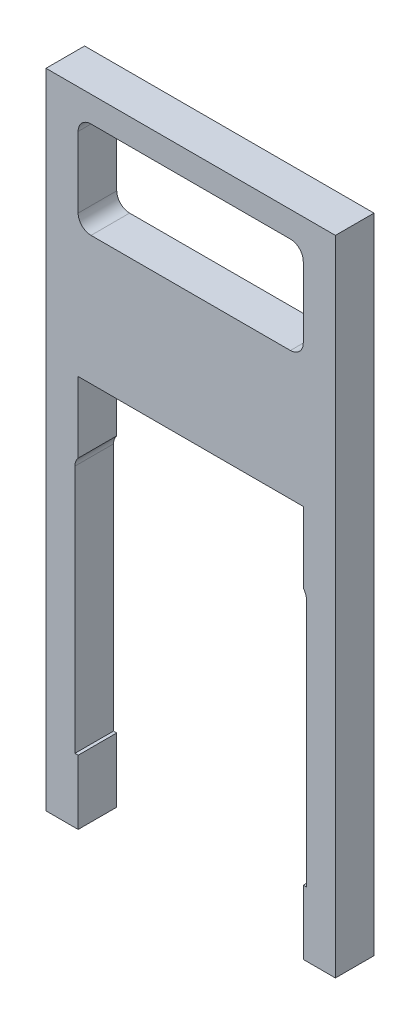
ISO-10303-21;
HEADER;
FILE_DESCRIPTION(('STEP AP214'),'2;1');
FILE_NAME('part.step','',(''),(''),'','','');
FILE_SCHEMA(('AUTOMOTIVE_DESIGN { 1 0 10303 214 1 1 1 1 }'));
ENDSEC;
DATA;
#1=APPLICATION_CONTEXT('core data for automotive mechanical design processes');
#2=APPLICATION_PROTOCOL_DEFINITION('international standard','automotive_design',2000,#1);
#3=PRODUCT_CONTEXT('',#1,'mechanical');
#4=PRODUCT('Part','Part','',(#3));
#5=PRODUCT_RELATED_PRODUCT_CATEGORY('part','',(#4));
#6=PRODUCT_DEFINITION_FORMATION('','',#4);
#7=PRODUCT_DEFINITION_CONTEXT('part definition',#1,'design');
#8=PRODUCT_DEFINITION('design','',#6,#7);
#9=PRODUCT_DEFINITION_SHAPE('','',#8);
#10=(LENGTH_UNIT() NAMED_UNIT(*) SI_UNIT(.MILLI.,.METRE.));
#11=(NAMED_UNIT(*) PLANE_ANGLE_UNIT() SI_UNIT($,.RADIAN.));
#12=(NAMED_UNIT(*) SI_UNIT($,.STERADIAN.) SOLID_ANGLE_UNIT());
#13=UNCERTAINTY_MEASURE_WITH_UNIT(LENGTH_MEASURE(1.E-05),#10,'distance_accuracy_value','');
#14=(GEOMETRIC_REPRESENTATION_CONTEXT(3) GLOBAL_UNCERTAINTY_ASSIGNED_CONTEXT((#13)) GLOBAL_UNIT_ASSIGNED_CONTEXT((#10,
#11,#12)) REPRESENTATION_CONTEXT('',''));
#15=CARTESIAN_POINT('',(0.,0.,0.));
#16=DIRECTION('',(0.,0.,1.));
#17=DIRECTION('',(1.,0.,0.));
#18=AXIS2_PLACEMENT_3D('',#15,#16,#17);
#19=CARTESIAN_POINT('',(22.225,58.42,0.));
#20=DIRECTION('',(1.,0.,0.));
#21=DIRECTION('',(0.,1.,0.));
#22=AXIS2_PLACEMENT_3D('',#19,#20,#21);
#23=PLANE('',#22);
#24=DIRECTION('',(0.,1.,0.));
#25=VECTOR('',#24,1.);
#26=CARTESIAN_POINT('',(22.225,58.42,7.62));
#27=LINE('',#26,#25);
#28=CARTESIAN_POINT('',(22.225,0.,7.62));
#29=VERTEX_POINT('',#28);
#30=CARTESIAN_POINT('',(22.225,13.97,7.62));
#31=VERTEX_POINT('',#30);
#32=EDGE_CURVE('E224',#29,#31,#27,.T.);
#33=ORIENTED_EDGE('',*,*,#32,.T.);
#34=DIRECTION('',(0.,0.,1.));
#35=VECTOR('',#34,1.);
#36=CARTESIAN_POINT('',(22.225,13.97,-51.1953367016958));
#37=LINE('',#36,#35);
#38=CARTESIAN_POINT('',(22.225,13.97,0.));
#39=VERTEX_POINT('',#38);
#40=EDGE_CURVE('E207',#39,#31,#37,.T.);
#41=ORIENTED_EDGE('',*,*,#40,.F.);
#42=DIRECTION('',(0.,1.,0.));
#43=VECTOR('',#42,1.);
#44=CARTESIAN_POINT('',(22.225,58.42,0.));
#45=LINE('',#44,#43);
#46=CARTESIAN_POINT('',(22.225,0.,0.));
#47=VERTEX_POINT('',#46);
#48=EDGE_CURVE('E221',#47,#39,#45,.T.);
#49=ORIENTED_EDGE('',*,*,#48,.F.);
#50=DIRECTION('',(0.,0.,1.));
#51=VECTOR('',#50,1.);
#52=CARTESIAN_POINT('',(22.225,0.,0.));
#53=LINE('',#52,#51);
#54=EDGE_CURVE('E244',#47,#29,#53,.T.);
#55=ORIENTED_EDGE('',*,*,#54,.T.);
#56=EDGE_LOOP('',(#33,#41,#49,#55));
#57=FACE_BOUND('',#56,.T.);
#58=ADVANCED_FACE('F43',(#57),#23,.F.);
#59=CARTESIAN_POINT('',(-22.225,58.42,0.));
#60=DIRECTION('',(-1.,0.,0.));
#61=DIRECTION('',(0.,-1.,0.));
#62=AXIS2_PLACEMENT_3D('',#59,#60,#61);
#63=PLANE('',#62);
#64=DIRECTION('',(0.,-1.,0.));
#65=VECTOR('',#64,1.);
#66=CARTESIAN_POINT('',(-22.225,58.42,0.));
#67=LINE('',#66,#65);
#68=CARTESIAN_POINT('',(-22.225,13.97,0.));
#69=VERTEX_POINT('',#68);
#70=CARTESIAN_POINT('',(-22.225,0.,0.));
#71=VERTEX_POINT('',#70);
#72=EDGE_CURVE('E255',#69,#71,#67,.T.);
#73=ORIENTED_EDGE('',*,*,#72,.F.);
#74=DIRECTION('',(0.,0.,1.));
#75=VECTOR('',#74,1.);
#76=CARTESIAN_POINT('',(-22.225,13.97,-51.1953367016958));
#77=LINE('',#76,#75);
#78=CARTESIAN_POINT('',(-22.225,13.97,7.62));
#79=VERTEX_POINT('',#78);
#80=EDGE_CURVE('E210',#69,#79,#77,.T.);
#81=ORIENTED_EDGE('',*,*,#80,.T.);
#82=DIRECTION('',(0.,-1.,0.));
#83=VECTOR('',#82,1.);
#84=CARTESIAN_POINT('',(-22.225,58.42,7.62));
#85=LINE('',#84,#83);
#86=CARTESIAN_POINT('',(-22.225,0.,7.62));
#87=VERTEX_POINT('',#86);
#88=EDGE_CURVE('E269',#79,#87,#85,.T.);
#89=ORIENTED_EDGE('',*,*,#88,.T.);
#90=DIRECTION('',(0.,0.,-1.));
#91=VECTOR('',#90,1.);
#92=CARTESIAN_POINT('',(-22.225,0.,0.));
#93=LINE('',#92,#91);
#94=EDGE_CURVE('E326',#87,#71,#93,.T.);
#95=ORIENTED_EDGE('',*,*,#94,.T.);
#96=EDGE_LOOP('',(#73,#81,#89,#95));
#97=FACE_BOUND('',#96,.T.);
#98=ADVANCED_FACE('F458',(#97),#63,.F.);
#99=CARTESIAN_POINT('',(22.225,41.91,7.62));
#100=VERTEX_POINT('',#99);
#101=CARTESIAN_POINT('',(22.225,55.88,7.62));
#102=VERTEX_POINT('',#101);
#103=EDGE_CURVE('E261',#100,#102,#27,.T.);
#104=ORIENTED_EDGE('',*,*,#103,.T.);
#105=DIRECTION('',(0.,0.,1.));
#106=VECTOR('',#105,1.);
#107=CARTESIAN_POINT('',(22.225,55.88,0.));
#108=LINE('',#107,#106);
#109=CARTESIAN_POINT('',(22.225,55.88,0.));
#110=VERTEX_POINT('',#109);
#111=EDGE_CURVE('E348',#102,#110,#108,.F.);
#112=ORIENTED_EDGE('',*,*,#111,.T.);
#113=CARTESIAN_POINT('',(22.225,41.91,0.));
#114=VERTEX_POINT('',#113);
#115=EDGE_CURVE('E234',#114,#110,#45,.T.);
#116=ORIENTED_EDGE('',*,*,#115,.F.);
#117=DIRECTION('',(0.,0.,1.));
#118=VECTOR('',#117,1.);
#119=CARTESIAN_POINT('',(22.225,41.91,0.));
#120=LINE('',#119,#118);
#121=EDGE_CURVE('E344',#114,#100,#120,.T.);
#122=ORIENTED_EDGE('',*,*,#121,.T.);
#123=EDGE_LOOP('',(#104,#112,#116,#122));
#124=FACE_BOUND('',#123,.T.);
#125=ADVANCED_FACE('F510',(#124),#23,.F.);
#126=CARTESIAN_POINT('',(-22.225,55.88,0.));
#127=VERTEX_POINT('',#126);
#128=CARTESIAN_POINT('',(-22.225,41.91,0.));
#129=VERTEX_POINT('',#128);
#130=EDGE_CURVE('E250',#127,#129,#67,.T.);
#131=ORIENTED_EDGE('',*,*,#130,.F.);
#132=DIRECTION('',(0.,0.,1.));
#133=VECTOR('',#132,1.);
#134=CARTESIAN_POINT('',(-22.225,55.88,7.62));
#135=LINE('',#134,#133);
#136=CARTESIAN_POINT('',(-22.225,55.88,7.62));
#137=VERTEX_POINT('',#136);
#138=EDGE_CURVE('E333',#127,#137,#135,.T.);
#139=ORIENTED_EDGE('',*,*,#138,.T.);
#140=CARTESIAN_POINT('',(-22.225,41.91,7.62));
#141=VERTEX_POINT('',#140);
#142=EDGE_CURVE('E241',#137,#141,#85,.T.);
#143=ORIENTED_EDGE('',*,*,#142,.T.);
#144=DIRECTION('',(0.,0.,1.));
#145=VECTOR('',#144,1.);
#146=CARTESIAN_POINT('',(-22.225,41.91,0.));
#147=LINE('',#146,#145);
#148=EDGE_CURVE('E330',#141,#129,#147,.F.);
#149=ORIENTED_EDGE('',*,*,#148,.T.);
#150=EDGE_LOOP('',(#131,#139,#143,#149));
#151=FACE_BOUND('',#150,.T.);
#152=ADVANCED_FACE('F397',(#151),#63,.F.);
#153=CARTESIAN_POINT('',(-28.575,-63.5,7.62));
#154=DIRECTION('',(0.,1.,0.));
#155=DIRECTION('',(0.,0.,1.));
#156=AXIS2_PLACEMENT_3D('',#153,#154,#155);
#157=PLANE('',#156);
#158=DIRECTION('',(1.,0.,0.));
#159=VECTOR('',#158,1.);
#160=CARTESIAN_POINT('',(-28.575,-63.5,7.62));
#161=LINE('',#160,#159);
#162=CARTESIAN_POINT('',(22.225,-63.5,7.62));
#163=VERTEX_POINT('',#162);
#164=CARTESIAN_POINT('',(28.575,-63.5,7.62));
#165=VERTEX_POINT('',#164);
#166=EDGE_CURVE('E288',#163,#165,#161,.T.);
#167=ORIENTED_EDGE('',*,*,#166,.F.);
#168=DIRECTION('',(0.,0.,1.));
#169=VECTOR('',#168,1.);
#170=CARTESIAN_POINT('',(22.225,-63.5,0.));
#171=LINE('',#170,#169);
#172=CARTESIAN_POINT('',(22.225,-63.5,0.));
#173=VERTEX_POINT('',#172);
#174=EDGE_CURVE('E270',#173,#163,#171,.T.);
#175=ORIENTED_EDGE('',*,*,#174,.F.);
#176=DIRECTION('',(1.,0.,0.));
#177=VECTOR('',#176,1.);
#178=CARTESIAN_POINT('',(-28.575,-63.5,0.));
#179=LINE('',#178,#177);
#180=CARTESIAN_POINT('',(28.575,-63.5,0.));
#181=VERTEX_POINT('',#180);
#182=EDGE_CURVE('E303',#173,#181,#179,.T.);
#183=ORIENTED_EDGE('',*,*,#182,.T.);
#184=DIRECTION('',(0.,0.,-1.));
#185=VECTOR('',#184,1.);
#186=CARTESIAN_POINT('',(28.575,-63.5,7.62));
#187=LINE('',#186,#185);
#188=EDGE_CURVE('E293',#165,#181,#187,.T.);
#189=ORIENTED_EDGE('',*,*,#188,.F.);
#190=EDGE_LOOP('',(#167,#175,#183,#189));
#191=FACE_BOUND('',#190,.T.);
#192=ADVANCED_FACE('F490',(#191),#157,.F.);
#193=CARTESIAN_POINT('',(28.575,-63.5,7.62));
#194=DIRECTION('',(-1.,0.,0.));
#195=DIRECTION('',(0.,0.,1.));
#196=AXIS2_PLACEMENT_3D('',#193,#194,#195);
#197=PLANE('',#196);
#198=DIRECTION('',(0.,1.,0.));
#199=VECTOR('',#198,1.);
#200=CARTESIAN_POINT('',(28.575,-63.5,0.));
#201=LINE('',#200,#199);
#202=CARTESIAN_POINT('',(28.575,63.5,0.));
#203=VERTEX_POINT('',#202);
#204=EDGE_CURVE('E273',#181,#203,#201,.T.);
#205=ORIENTED_EDGE('',*,*,#204,.T.);
#206=DIRECTION('',(0.,0.,-1.));
#207=VECTOR('',#206,1.);
#208=CARTESIAN_POINT('',(28.575,63.5,7.62));
#209=LINE('',#208,#207);
#210=CARTESIAN_POINT('',(28.575,63.5,7.62));
#211=VERTEX_POINT('',#210);
#212=EDGE_CURVE('E318',#211,#203,#209,.T.);
#213=ORIENTED_EDGE('',*,*,#212,.F.);
#214=DIRECTION('',(0.,1.,0.));
#215=VECTOR('',#214,1.);
#216=CARTESIAN_POINT('',(28.575,-63.5,7.62));
#217=LINE('',#216,#215);
#218=EDGE_CURVE('E277',#165,#211,#217,.T.);
#219=ORIENTED_EDGE('',*,*,#218,.F.);
#220=ORIENTED_EDGE('',*,*,#188,.T.);
#221=EDGE_LOOP('',(#205,#213,#219,#220));
#222=FACE_BOUND('',#221,.T.);
#223=ADVANCED_FACE('F494',(#222),#197,.F.);
#224=CARTESIAN_POINT('',(-28.575,63.5,7.62));
#225=DIRECTION('',(0.,-1.,0.));
#226=DIRECTION('',(0.,0.,-1.));
#227=AXIS2_PLACEMENT_3D('',#224,#225,#226);
#228=PLANE('',#227);
#229=DIRECTION('',(-1.,0.,0.));
#230=VECTOR('',#229,1.);
#231=CARTESIAN_POINT('',(-28.575,63.5,0.));
#232=LINE('',#231,#230);
#233=CARTESIAN_POINT('',(-28.575,63.5,0.));
#234=VERTEX_POINT('',#233);
#235=EDGE_CURVE('E297',#203,#234,#232,.T.);
#236=ORIENTED_EDGE('',*,*,#235,.T.);
#237=DIRECTION('',(0.,0.,-1.));
#238=VECTOR('',#237,1.);
#239=CARTESIAN_POINT('',(-28.575,63.5,7.62));
#240=LINE('',#239,#238);
#241=CARTESIAN_POINT('',(-28.575,63.5,7.62));
#242=VERTEX_POINT('',#241);
#243=EDGE_CURVE('E314',#242,#234,#240,.T.);
#244=ORIENTED_EDGE('',*,*,#243,.F.);
#245=DIRECTION('',(-1.,0.,0.));
#246=VECTOR('',#245,1.);
#247=CARTESIAN_POINT('',(-28.575,63.5,7.62));
#248=LINE('',#247,#246);
#249=EDGE_CURVE('E281',#211,#242,#248,.T.);
#250=ORIENTED_EDGE('',*,*,#249,.F.);
#251=ORIENTED_EDGE('',*,*,#212,.T.);
#252=EDGE_LOOP('',(#236,#244,#250,#251));
#253=FACE_BOUND('',#252,.T.);
#254=ADVANCED_FACE('F496',(#253),#228,.F.);
#255=CARTESIAN_POINT('',(-28.575,-63.5,7.62));
#256=DIRECTION('',(1.,0.,0.));
#257=DIRECTION('',(0.,0.,-1.));
#258=AXIS2_PLACEMENT_3D('',#255,#256,#257);
#259=PLANE('',#258);
#260=DIRECTION('',(0.,-1.,0.));
#261=VECTOR('',#260,1.);
#262=CARTESIAN_POINT('',(-28.575,-63.5,0.));
#263=LINE('',#262,#261);
#264=CARTESIAN_POINT('',(-28.575,-63.5,0.));
#265=VERTEX_POINT('',#264);
#266=EDGE_CURVE('E300',#234,#265,#263,.T.);
#267=ORIENTED_EDGE('',*,*,#266,.T.);
#268=DIRECTION('',(0.,0.,-1.));
#269=VECTOR('',#268,1.);
#270=CARTESIAN_POINT('',(-28.575,-63.5,7.62));
#271=LINE('',#270,#269);
#272=CARTESIAN_POINT('',(-28.575,-63.5,7.62));
#273=VERTEX_POINT('',#272);
#274=EDGE_CURVE('E310',#273,#265,#271,.T.);
#275=ORIENTED_EDGE('',*,*,#274,.F.);
#276=DIRECTION('',(0.,-1.,0.));
#277=VECTOR('',#276,1.);
#278=CARTESIAN_POINT('',(-28.575,-63.5,7.62));
#279=LINE('',#278,#277);
#280=EDGE_CURVE('E285',#242,#273,#279,.T.);
#281=ORIENTED_EDGE('',*,*,#280,.F.);
#282=ORIENTED_EDGE('',*,*,#243,.T.);
#283=EDGE_LOOP('',(#267,#275,#281,#282));
#284=FACE_BOUND('',#283,.T.);
#285=ADVANCED_FACE('F502',(#284),#259,.F.);
#286=CARTESIAN_POINT('',(-22.225,-63.5,0.));
#287=VERTEX_POINT('',#286);
#288=EDGE_CURVE('E282',#265,#287,#179,.T.);
#289=ORIENTED_EDGE('',*,*,#288,.T.);
#290=DIRECTION('',(0.,0.,1.));
#291=VECTOR('',#290,1.);
#292=CARTESIAN_POINT('',(-22.225,-63.5,0.));
#293=LINE('',#292,#291);
#294=CARTESIAN_POINT('',(-22.225,-63.5,7.62));
#295=VERTEX_POINT('',#294);
#296=EDGE_CURVE('E254',#287,#295,#293,.T.);
#297=ORIENTED_EDGE('',*,*,#296,.T.);
#298=EDGE_CURVE('E289',#273,#295,#161,.T.);
#299=ORIENTED_EDGE('',*,*,#298,.F.);
#300=ORIENTED_EDGE('',*,*,#274,.T.);
#301=EDGE_LOOP('',(#289,#297,#299,#300));
#302=FACE_BOUND('',#301,.T.);
#303=ADVANCED_FACE('F505',(#302),#157,.F.);
#304=CARTESIAN_POINT('',(0.,0.,7.62));
#305=DIRECTION('',(0.,0.,-1.));
#306=DIRECTION('',(-1.,0.,0.));
#307=AXIS2_PLACEMENT_3D('',#304,#305,#306);
#308=PLANE('',#307);
#309=ORIENTED_EDGE('',*,*,#103,.F.);
#310=CARTESIAN_POINT('',(19.685,41.91,7.62));
#311=DIRECTION('',(0.,0.,-1.));
#312=DIRECTION('',(-1.,0.,0.));
#313=AXIS2_PLACEMENT_3D('',#310,#311,#312);
#314=CIRCLE('',#313,2.54);
#315=CARTESIAN_POINT('',(19.685,39.37,7.62));
#316=VERTEX_POINT('',#315);
#317=EDGE_CURVE('E66',#100,#316,#314,.T.);
#318=ORIENTED_EDGE('',*,*,#317,.T.);
#319=DIRECTION('',(-1.,0.,0.));
#320=VECTOR('',#319,1.);
#321=CARTESIAN_POINT('',(-22.225,39.37,7.62));
#322=LINE('',#321,#320);
#323=CARTESIAN_POINT('',(-19.685,39.37,7.62));
#324=VERTEX_POINT('',#323);
#325=EDGE_CURVE('E215',#316,#324,#322,.T.);
#326=ORIENTED_EDGE('',*,*,#325,.T.);
#327=CARTESIAN_POINT('',(-19.685,41.91,7.62));
#328=DIRECTION('',(0.,0.,-1.));
#329=DIRECTION('',(-1.,0.,0.));
#330=AXIS2_PLACEMENT_3D('',#327,#328,#329);
#331=CIRCLE('',#330,2.54);
#332=EDGE_CURVE('E52',#324,#141,#331,.T.);
#333=ORIENTED_EDGE('',*,*,#332,.T.);
#334=ORIENTED_EDGE('',*,*,#142,.F.);
#335=CARTESIAN_POINT('',(-19.685,55.88,7.62));
#336=DIRECTION('',(0.,0.,-1.));
#337=DIRECTION('',(-1.,0.,0.));
#338=AXIS2_PLACEMENT_3D('',#335,#336,#337);
#339=CIRCLE('',#338,2.54);
#340=CARTESIAN_POINT('',(-19.685,58.42,7.62));
#341=VERTEX_POINT('',#340);
#342=EDGE_CURVE('E364',#137,#341,#339,.T.);
#343=ORIENTED_EDGE('',*,*,#342,.T.);
#344=DIRECTION('',(-1.,0.,0.));
#345=VECTOR('',#344,1.);
#346=CARTESIAN_POINT('',(-22.225,58.42,7.62));
#347=LINE('',#346,#345);
#348=CARTESIAN_POINT('',(19.685,58.42,7.62));
#349=VERTEX_POINT('',#348);
#350=EDGE_CURVE('E260',#349,#341,#347,.T.);
#351=ORIENTED_EDGE('',*,*,#350,.F.);
#352=CARTESIAN_POINT('',(19.685,55.88,7.62));
#353=DIRECTION('',(0.,0.,-1.));
#354=DIRECTION('',(-1.,0.,0.));
#355=AXIS2_PLACEMENT_3D('',#352,#353,#354);
#356=CIRCLE('',#355,2.54);
#357=EDGE_CURVE('E370',#349,#102,#356,.T.);
#358=ORIENTED_EDGE('',*,*,#357,.T.);
#359=EDGE_LOOP('',(#309,#318,#326,#333,#334,#343,#351,#358));
#360=FACE_BOUND('',#359,.T.);
#361=ORIENTED_EDGE('',*,*,#32,.F.);
#362=CARTESIAN_POINT('',(20.32,-1.68005208252603,7.62));
#363=DIRECTION('',(0.,0.,-1.));
#364=DIRECTION('',(-1.,0.,0.));
#365=AXIS2_PLACEMENT_3D('',#362,#363,#364);
#366=CIRCLE('',#365,2.54);
#367=CARTESIAN_POINT('',(22.86,-1.68005208252603,7.62));
#368=VERTEX_POINT('',#367);
#369=EDGE_CURVE('E376',#29,#368,#366,.T.);
#370=ORIENTED_EDGE('',*,*,#369,.T.);
#371=DIRECTION('',(0.,1.,0.));
#372=VECTOR('',#371,1.);
#373=CARTESIAN_POINT('',(22.86,-50.8,7.62));
#374=LINE('',#373,#372);
#375=CARTESIAN_POINT('',(22.86,-50.8,7.62));
#376=VERTEX_POINT('',#375);
#377=EDGE_CURVE('E418',#376,#368,#374,.T.);
#378=ORIENTED_EDGE('',*,*,#377,.F.);
#379=DIRECTION('',(1.,0.,0.));
#380=VECTOR('',#379,1.);
#381=CARTESIAN_POINT('',(-22.86,-50.8,7.62));
#382=LINE('',#381,#380);
#383=CARTESIAN_POINT('',(22.225,-50.8,7.62));
#384=VERTEX_POINT('',#383);
#385=EDGE_CURVE('E429',#384,#376,#382,.T.);
#386=ORIENTED_EDGE('',*,*,#385,.F.);
#387=EDGE_CURVE('E256',#163,#384,#27,.T.);
#388=ORIENTED_EDGE('',*,*,#387,.F.);
#389=ORIENTED_EDGE('',*,*,#166,.T.);
#390=ORIENTED_EDGE('',*,*,#218,.T.);
#391=ORIENTED_EDGE('',*,*,#249,.T.);
#392=ORIENTED_EDGE('',*,*,#280,.T.);
#393=ORIENTED_EDGE('',*,*,#298,.T.);
#394=CARTESIAN_POINT('',(-22.225,-50.8,7.62));
#395=VERTEX_POINT('',#394);
#396=EDGE_CURVE('E265',#395,#295,#85,.T.);
#397=ORIENTED_EDGE('',*,*,#396,.F.);
#398=CARTESIAN_POINT('',(-22.86,-50.8,7.62));
#399=VERTEX_POINT('',#398);
#400=EDGE_CURVE('E430',#399,#395,#382,.T.);
#401=ORIENTED_EDGE('',*,*,#400,.F.);
#402=DIRECTION('',(0.,-1.,0.));
#403=VECTOR('',#402,1.);
#404=CARTESIAN_POINT('',(-22.86,-50.8,7.62));
#405=LINE('',#404,#403);
#406=CARTESIAN_POINT('',(-22.86,-1.68005208252602,7.62));
#407=VERTEX_POINT('',#406);
#408=EDGE_CURVE('E410',#407,#399,#405,.T.);
#409=ORIENTED_EDGE('',*,*,#408,.F.);
#410=CARTESIAN_POINT('',(-20.32,-1.68005208252602,7.62));
#411=DIRECTION('',(0.,0.,-1.));
#412=DIRECTION('',(-1.,0.,0.));
#413=AXIS2_PLACEMENT_3D('',#410,#411,#412);
#414=CIRCLE('',#413,2.54);
#415=EDGE_CURVE('E381',#407,#87,#414,.T.);
#416=ORIENTED_EDGE('',*,*,#415,.T.);
#417=ORIENTED_EDGE('',*,*,#88,.F.);
#418=DIRECTION('',(1.,0.,0.));
#419=VECTOR('',#418,1.);
#420=CARTESIAN_POINT('',(-22.225,13.97,7.62));
#421=LINE('',#420,#419);
#422=EDGE_CURVE('E793',#79,#31,#421,.T.);
#423=ORIENTED_EDGE('',*,*,#422,.T.);
#424=EDGE_LOOP('',(#361,#370,#378,#386,#388,#389,#390,#391,#392,#393,#397,#401,#409,#416,#417,#423));
#425=FACE_BOUND('',#424,.T.);
#426=ADVANCED_FACE('F393',(#360,#425),#308,.F.);
#427=CARTESIAN_POINT('',(0.,0.,0.));
#428=DIRECTION('',(0.,0.,-1.));
#429=DIRECTION('',(-1.,0.,0.));
#430=AXIS2_PLACEMENT_3D('',#427,#428,#429);
#431=PLANE('',#430);
#432=DIRECTION('',(-1.,0.,0.));
#433=VECTOR('',#432,1.);
#434=CARTESIAN_POINT('',(-22.225,39.37,0.));
#435=LINE('',#434,#433);
#436=CARTESIAN_POINT('',(19.685,39.37,0.));
#437=VERTEX_POINT('',#436);
#438=CARTESIAN_POINT('',(-19.685,39.37,0.));
#439=VERTEX_POINT('',#438);
#440=EDGE_CURVE('E226',#437,#439,#435,.T.);
#441=ORIENTED_EDGE('',*,*,#440,.F.);
#442=CARTESIAN_POINT('',(19.685,41.91,0.));
#443=DIRECTION('',(0.,0.,-1.));
#444=DIRECTION('',(-1.,0.,0.));
#445=AXIS2_PLACEMENT_3D('',#442,#443,#444);
#446=CIRCLE('',#445,2.54);
#447=EDGE_CURVE('E389',#437,#114,#446,.F.);
#448=ORIENTED_EDGE('',*,*,#447,.T.);
#449=ORIENTED_EDGE('',*,*,#115,.T.);
#450=CARTESIAN_POINT('',(19.685,55.88,0.));
#451=DIRECTION('',(0.,0.,-1.));
#452=DIRECTION('',(-1.,0.,0.));
#453=AXIS2_PLACEMENT_3D('',#450,#451,#452);
#454=CIRCLE('',#453,2.54);
#455=CARTESIAN_POINT('',(19.685,58.42,0.));
#456=VERTEX_POINT('',#455);
#457=EDGE_CURVE('E373',#110,#456,#454,.F.);
#458=ORIENTED_EDGE('',*,*,#457,.T.);
#459=DIRECTION('',(-1.,0.,0.));
#460=VECTOR('',#459,1.);
#461=CARTESIAN_POINT('',(-22.225,58.42,0.));
#462=LINE('',#461,#460);
#463=CARTESIAN_POINT('',(-19.685,58.42,0.));
#464=VERTEX_POINT('',#463);
#465=EDGE_CURVE('E239',#456,#464,#462,.T.);
#466=ORIENTED_EDGE('',*,*,#465,.T.);
#467=CARTESIAN_POINT('',(-19.685,55.88,0.));
#468=DIRECTION('',(0.,0.,-1.));
#469=DIRECTION('',(-1.,0.,0.));
#470=AXIS2_PLACEMENT_3D('',#467,#468,#469);
#471=CIRCLE('',#470,2.54);
#472=EDGE_CURVE('E367',#464,#127,#471,.F.);
#473=ORIENTED_EDGE('',*,*,#472,.T.);
#474=ORIENTED_EDGE('',*,*,#130,.T.);
#475=CARTESIAN_POINT('',(-19.685,41.91,0.));
#476=DIRECTION('',(0.,0.,-1.));
#477=DIRECTION('',(-1.,0.,0.));
#478=AXIS2_PLACEMENT_3D('',#475,#476,#477);
#479=CIRCLE('',#478,2.54);
#480=EDGE_CURVE('E11',#129,#439,#479,.F.);
#481=ORIENTED_EDGE('',*,*,#480,.T.);
#482=EDGE_LOOP('',(#441,#448,#449,#458,#466,#473,#474,#481));
#483=FACE_BOUND('',#482,.T.);
#484=DIRECTION('',(0.,1.,0.));
#485=VECTOR('',#484,1.);
#486=CARTESIAN_POINT('',(22.86,-50.8,0.));
#487=LINE('',#486,#485);
#488=CARTESIAN_POINT('',(22.86,-50.8,0.));
#489=VERTEX_POINT('',#488);
#490=CARTESIAN_POINT('',(22.86,-1.68005208252603,0.));
#491=VERTEX_POINT('',#490);
#492=EDGE_CURVE('E423',#489,#491,#487,.T.);
#493=ORIENTED_EDGE('',*,*,#492,.T.);
#494=CARTESIAN_POINT('',(20.32,-1.68005208252603,0.));
#495=DIRECTION('',(0.,0.,-1.));
#496=DIRECTION('',(-1.,0.,0.));
#497=AXIS2_PLACEMENT_3D('',#494,#495,#496);
#498=CIRCLE('',#497,2.54);
#499=EDGE_CURVE('E231',#491,#47,#498,.F.);
#500=ORIENTED_EDGE('',*,*,#499,.T.);
#501=ORIENTED_EDGE('',*,*,#48,.T.);
#502=DIRECTION('',(1.,0.,0.));
#503=VECTOR('',#502,1.);
#504=CARTESIAN_POINT('',(-22.225,13.97,0.));
#505=LINE('',#504,#503);
#506=EDGE_CURVE('E204',#69,#39,#505,.T.);
#507=ORIENTED_EDGE('',*,*,#506,.F.);
#508=ORIENTED_EDGE('',*,*,#72,.T.);
#509=CARTESIAN_POINT('',(-20.32,-1.68005208252602,0.));
#510=DIRECTION('',(0.,0.,-1.));
#511=DIRECTION('',(-1.,0.,0.));
#512=AXIS2_PLACEMENT_3D('',#509,#510,#511);
#513=CIRCLE('',#512,2.54);
#514=CARTESIAN_POINT('',(-22.86,-1.68005208252602,0.));
#515=VERTEX_POINT('',#514);
#516=EDGE_CURVE('E384',#71,#515,#513,.F.);
#517=ORIENTED_EDGE('',*,*,#516,.T.);
#518=DIRECTION('',(0.,-1.,0.));
#519=VECTOR('',#518,1.);
#520=CARTESIAN_POINT('',(-22.86,-50.8,0.));
#521=LINE('',#520,#519);
#522=CARTESIAN_POINT('',(-22.86,-50.8,0.));
#523=VERTEX_POINT('',#522);
#524=EDGE_CURVE('E414',#515,#523,#521,.T.);
#525=ORIENTED_EDGE('',*,*,#524,.T.);
#526=DIRECTION('',(1.,0.,0.));
#527=VECTOR('',#526,1.);
#528=CARTESIAN_POINT('',(-22.86,-50.8,0.));
#529=LINE('',#528,#527);
#530=CARTESIAN_POINT('',(-22.225,-50.8,0.));
#531=VERTEX_POINT('',#530);
#532=EDGE_CURVE('E419',#523,#531,#529,.T.);
#533=ORIENTED_EDGE('',*,*,#532,.T.);
#534=EDGE_CURVE('E249',#531,#287,#67,.T.);
#535=ORIENTED_EDGE('',*,*,#534,.T.);
#536=ORIENTED_EDGE('',*,*,#288,.F.);
#537=ORIENTED_EDGE('',*,*,#266,.F.);
#538=ORIENTED_EDGE('',*,*,#235,.F.);
#539=ORIENTED_EDGE('',*,*,#204,.F.);
#540=ORIENTED_EDGE('',*,*,#182,.F.);
#541=CARTESIAN_POINT('',(22.225,-50.8,0.));
#542=VERTEX_POINT('',#541);
#543=EDGE_CURVE('E233',#173,#542,#45,.T.);
#544=ORIENTED_EDGE('',*,*,#543,.T.);
#545=EDGE_CURVE('E417',#542,#489,#529,.T.);
#546=ORIENTED_EDGE('',*,*,#545,.T.);
#547=EDGE_LOOP('',(#493,#500,#501,#507,#508,#517,#525,#533,#535,#536,#537,#538,#539,#540,#544,#546));
#548=FACE_BOUND('',#547,.T.);
#549=ADVANCED_FACE('F229',(#483,#548),#431,.T.);
#550=ORIENTED_EDGE('',*,*,#387,.T.);
#551=DIRECTION('',(0.,0.,-1.));
#552=VECTOR('',#551,1.);
#553=CARTESIAN_POINT('',(22.225,-50.8,0.));
#554=LINE('',#553,#552);
#555=EDGE_CURVE('E440',#384,#542,#554,.T.);
#556=ORIENTED_EDGE('',*,*,#555,.T.);
#557=ORIENTED_EDGE('',*,*,#543,.F.);
#558=ORIENTED_EDGE('',*,*,#174,.T.);
#559=EDGE_LOOP('',(#550,#556,#557,#558));
#560=FACE_BOUND('',#559,.T.);
#561=ADVANCED_FACE('F507',(#560),#23,.F.);
#562=ORIENTED_EDGE('',*,*,#534,.F.);
#563=DIRECTION('',(0.,0.,1.));
#564=VECTOR('',#563,1.);
#565=CARTESIAN_POINT('',(-22.225,-50.8,0.));
#566=LINE('',#565,#564);
#567=EDGE_CURVE('E322',#531,#395,#566,.T.);
#568=ORIENTED_EDGE('',*,*,#567,.T.);
#569=ORIENTED_EDGE('',*,*,#396,.T.);
#570=ORIENTED_EDGE('',*,*,#296,.F.);
#571=EDGE_LOOP('',(#562,#568,#569,#570));
#572=FACE_BOUND('',#571,.T.);
#573=ADVANCED_FACE('F476',(#572),#63,.F.);
#574=CARTESIAN_POINT('',(-22.225,58.42,0.));
#575=DIRECTION('',(0.,1.,0.));
#576=DIRECTION('',(0.,0.,1.));
#577=AXIS2_PLACEMENT_3D('',#574,#575,#576);
#578=PLANE('',#577);
#579=ORIENTED_EDGE('',*,*,#350,.T.);
#580=DIRECTION('',(0.,0.,1.));
#581=VECTOR('',#580,1.);
#582=CARTESIAN_POINT('',(-19.685,58.42,0.));
#583=LINE('',#582,#581);
#584=EDGE_CURVE('E341',#341,#464,#583,.F.);
#585=ORIENTED_EDGE('',*,*,#584,.T.);
#586=ORIENTED_EDGE('',*,*,#465,.F.);
#587=DIRECTION('',(0.,0.,1.));
#588=VECTOR('',#587,1.);
#589=CARTESIAN_POINT('',(19.685,58.42,7.62));
#590=LINE('',#589,#588);
#591=EDGE_CURVE('E337',#456,#349,#590,.T.);
#592=ORIENTED_EDGE('',*,*,#591,.T.);
#593=EDGE_LOOP('',(#579,#585,#586,#592));
#594=FACE_BOUND('',#593,.T.);
#595=ADVANCED_FACE('F515',(#594),#578,.F.);
#596=CARTESIAN_POINT('',(-22.86,-50.8,0.));
#597=DIRECTION('',(0.,-1.,0.));
#598=DIRECTION('',(0.,0.,-1.));
#599=AXIS2_PLACEMENT_3D('',#596,#597,#598);
#600=PLANE('',#599);
#601=ORIENTED_EDGE('',*,*,#532,.F.);
#602=DIRECTION('',(0.,0.,1.));
#603=VECTOR('',#602,1.);
#604=CARTESIAN_POINT('',(-22.86,-50.8,0.));
#605=LINE('',#604,#603);
#606=EDGE_CURVE('E426',#523,#399,#605,.T.);
#607=ORIENTED_EDGE('',*,*,#606,.T.);
#608=ORIENTED_EDGE('',*,*,#400,.T.);
#609=ORIENTED_EDGE('',*,*,#567,.F.);
#610=EDGE_LOOP('',(#601,#607,#608,#609));
#611=FACE_BOUND('',#610,.T.);
#612=ADVANCED_FACE('F471',(#611),#600,.F.);
#613=CARTESIAN_POINT('',(-22.86,-50.8,0.));
#614=DIRECTION('',(-1.,0.,0.));
#615=DIRECTION('',(0.,0.,1.));
#616=AXIS2_PLACEMENT_3D('',#613,#614,#615);
#617=PLANE('',#616);
#618=ORIENTED_EDGE('',*,*,#524,.F.);
#619=DIRECTION('',(0.,0.,1.));
#620=VECTOR('',#619,1.);
#621=CARTESIAN_POINT('',(-22.86,-1.68005208252602,0.));
#622=LINE('',#621,#620);
#623=EDGE_CURVE('E354',#515,#407,#622,.T.);
#624=ORIENTED_EDGE('',*,*,#623,.T.);
#625=ORIENTED_EDGE('',*,*,#408,.T.);
#626=ORIENTED_EDGE('',*,*,#606,.F.);
#627=EDGE_LOOP('',(#618,#624,#625,#626));
#628=FACE_BOUND('',#627,.T.);
#629=ADVANCED_FACE('F466',(#628),#617,.F.);
#630=ORIENTED_EDGE('',*,*,#385,.T.);
#631=DIRECTION('',(0.,0.,1.));
#632=VECTOR('',#631,1.);
#633=CARTESIAN_POINT('',(22.86,-50.8,0.));
#634=LINE('',#633,#632);
#635=EDGE_CURVE('E436',#489,#376,#634,.T.);
#636=ORIENTED_EDGE('',*,*,#635,.F.);
#637=ORIENTED_EDGE('',*,*,#545,.F.);
#638=ORIENTED_EDGE('',*,*,#555,.F.);
#639=EDGE_LOOP('',(#630,#636,#637,#638));
#640=FACE_BOUND('',#639,.T.);
#641=ADVANCED_FACE('F535',(#640),#600,.F.);
#642=CARTESIAN_POINT('',(22.86,-50.8,0.));
#643=DIRECTION('',(1.,0.,0.));
#644=DIRECTION('',(0.,0.,-1.));
#645=AXIS2_PLACEMENT_3D('',#642,#643,#644);
#646=PLANE('',#645);
#647=ORIENTED_EDGE('',*,*,#377,.T.);
#648=DIRECTION('',(0.,0.,-1.));
#649=VECTOR('',#648,1.);
#650=CARTESIAN_POINT('',(22.86,-1.68005208252603,0.));
#651=LINE('',#650,#649);
#652=EDGE_CURVE('E351',#368,#491,#651,.T.);
#653=ORIENTED_EDGE('',*,*,#652,.T.);
#654=ORIENTED_EDGE('',*,*,#492,.F.);
#655=ORIENTED_EDGE('',*,*,#635,.T.);
#656=EDGE_LOOP('',(#647,#653,#654,#655));
#657=FACE_BOUND('',#656,.T.);
#658=ADVANCED_FACE('F607',(#657),#646,.F.);
#659=CARTESIAN_POINT('',(-22.225,13.97,-51.1953367016958));
#660=DIRECTION('',(0.,-1.,0.));
#661=DIRECTION('',(0.,0.,-1.));
#662=AXIS2_PLACEMENT_3D('',#659,#660,#661);
#663=PLANE('',#662);
#664=ORIENTED_EDGE('',*,*,#80,.F.);
#665=ORIENTED_EDGE('',*,*,#506,.T.);
#666=ORIENTED_EDGE('',*,*,#40,.T.);
#667=ORIENTED_EDGE('',*,*,#422,.F.);
#668=EDGE_LOOP('',(#664,#665,#666,#667));
#669=FACE_BOUND('',#668,.T.);
#670=ADVANCED_FACE('F206',(#669),#663,.T.);
#671=CARTESIAN_POINT('',(-22.225,39.37,-51.1953367016958));
#672=DIRECTION('',(0.,1.,0.));
#673=DIRECTION('',(0.,0.,1.));
#674=AXIS2_PLACEMENT_3D('',#671,#672,#673);
#675=PLANE('',#674);
#676=ORIENTED_EDGE('',*,*,#325,.F.);
#677=DIRECTION('',(0.,0.,1.));
#678=VECTOR('',#677,1.);
#679=CARTESIAN_POINT('',(19.685,39.37,-51.1953367016958));
#680=LINE('',#679,#678);
#681=EDGE_CURVE('E361',#316,#437,#680,.F.);
#682=ORIENTED_EDGE('',*,*,#681,.T.);
#683=ORIENTED_EDGE('',*,*,#440,.T.);
#684=DIRECTION('',(0.,0.,1.));
#685=VECTOR('',#684,1.);
#686=CARTESIAN_POINT('',(-19.685,39.37,-51.1953367016958));
#687=LINE('',#686,#685);
#688=EDGE_CURVE('E358',#439,#324,#687,.T.);
#689=ORIENTED_EDGE('',*,*,#688,.T.);
#690=EDGE_LOOP('',(#676,#682,#683,#689));
#691=FACE_BOUND('',#690,.T.);
#692=ADVANCED_FACE('F405',(#691),#675,.T.);
#693=CARTESIAN_POINT('',(-19.685,55.88,0.));
#694=DIRECTION('',(0.,0.,-1.));
#695=DIRECTION('',(-1.,0.,0.));
#696=AXIS2_PLACEMENT_3D('',#693,#694,#695);
#697=CYLINDRICAL_SURFACE('',#696,2.54);
#698=ORIENTED_EDGE('',*,*,#472,.F.);
#699=ORIENTED_EDGE('',*,*,#584,.F.);
#700=ORIENTED_EDGE('',*,*,#342,.F.);
#701=ORIENTED_EDGE('',*,*,#138,.F.);
#702=EDGE_LOOP('',(#698,#699,#700,#701));
#703=FACE_BOUND('',#702,.T.);
#704=ADVANCED_FACE('F542',(#703),#697,.F.);
#705=CARTESIAN_POINT('',(19.685,55.88,0.));
#706=DIRECTION('',(0.,0.,-1.));
#707=DIRECTION('',(-1.,0.,0.));
#708=AXIS2_PLACEMENT_3D('',#705,#706,#707);
#709=CYLINDRICAL_SURFACE('',#708,2.54);
#710=ORIENTED_EDGE('',*,*,#457,.F.);
#711=ORIENTED_EDGE('',*,*,#111,.F.);
#712=ORIENTED_EDGE('',*,*,#357,.F.);
#713=ORIENTED_EDGE('',*,*,#591,.F.);
#714=EDGE_LOOP('',(#710,#711,#712,#713));
#715=FACE_BOUND('',#714,.T.);
#716=ADVANCED_FACE('F545',(#715),#709,.F.);
#717=CARTESIAN_POINT('',(20.32,-1.68005208252603,0.));
#718=DIRECTION('',(0.,0.,-1.));
#719=DIRECTION('',(-1.,0.,0.));
#720=AXIS2_PLACEMENT_3D('',#717,#718,#719);
#721=CYLINDRICAL_SURFACE('',#720,2.54);
#722=ORIENTED_EDGE('',*,*,#499,.F.);
#723=ORIENTED_EDGE('',*,*,#652,.F.);
#724=ORIENTED_EDGE('',*,*,#369,.F.);
#725=ORIENTED_EDGE('',*,*,#54,.F.);
#726=EDGE_LOOP('',(#722,#723,#724,#725));
#727=FACE_BOUND('',#726,.T.);
#728=ADVANCED_FACE('F555',(#727),#721,.F.);
#729=CARTESIAN_POINT('',(-20.32,-1.68005208252602,0.));
#730=DIRECTION('',(0.,0.,1.));
#731=DIRECTION('',(1.,0.,0.));
#732=AXIS2_PLACEMENT_3D('',#729,#730,#731);
#733=CYLINDRICAL_SURFACE('',#732,2.54);
#734=ORIENTED_EDGE('',*,*,#516,.F.);
#735=ORIENTED_EDGE('',*,*,#94,.F.);
#736=ORIENTED_EDGE('',*,*,#415,.F.);
#737=ORIENTED_EDGE('',*,*,#623,.F.);
#738=EDGE_LOOP('',(#734,#735,#736,#737));
#739=FACE_BOUND('',#738,.T.);
#740=ADVANCED_FACE('F461',(#739),#733,.F.);
#741=CARTESIAN_POINT('',(19.685,41.91,0.));
#742=DIRECTION('',(0.,0.,1.));
#743=DIRECTION('',(1.,0.,0.));
#744=AXIS2_PLACEMENT_3D('',#741,#742,#743);
#745=CYLINDRICAL_SURFACE('',#744,2.54);
#746=ORIENTED_EDGE('',*,*,#447,.F.);
#747=ORIENTED_EDGE('',*,*,#681,.F.);
#748=ORIENTED_EDGE('',*,*,#317,.F.);
#749=ORIENTED_EDGE('',*,*,#121,.F.);
#750=EDGE_LOOP('',(#746,#747,#748,#749));
#751=FACE_BOUND('',#750,.T.);
#752=ADVANCED_FACE('F549',(#751),#745,.F.);
#753=CARTESIAN_POINT('',(-19.685,41.91,-51.1953367016958));
#754=DIRECTION('',(0.,0.,1.));
#755=DIRECTION('',(1.,0.,0.));
#756=AXIS2_PLACEMENT_3D('',#753,#754,#755);
#757=CYLINDRICAL_SURFACE('',#756,2.54);
#758=ORIENTED_EDGE('',*,*,#480,.F.);
#759=ORIENTED_EDGE('',*,*,#148,.F.);
#760=ORIENTED_EDGE('',*,*,#332,.F.);
#761=ORIENTED_EDGE('',*,*,#688,.F.);
#762=EDGE_LOOP('',(#758,#759,#760,#761));
#763=FACE_BOUND('',#762,.T.);
#764=ADVANCED_FACE('F45',(#763),#757,.F.);
#765=CLOSED_SHELL('',(#58,#98,#125,#152,#192,#223,#254,#285,#303,#426,#549,#561,#573,#595,#612,
#629,#641,#658,#670,#692,#704,#716,#728,#740,#752,#764));
#766=MANIFOLD_SOLID_BREP('B2',#765);
#767=ADVANCED_BREP_SHAPE_REPRESENTATION('',(#18,#766),#14);
#768=SHAPE_DEFINITION_REPRESENTATION(#9,#767);
ENDSEC;
END-ISO-10303-21;
